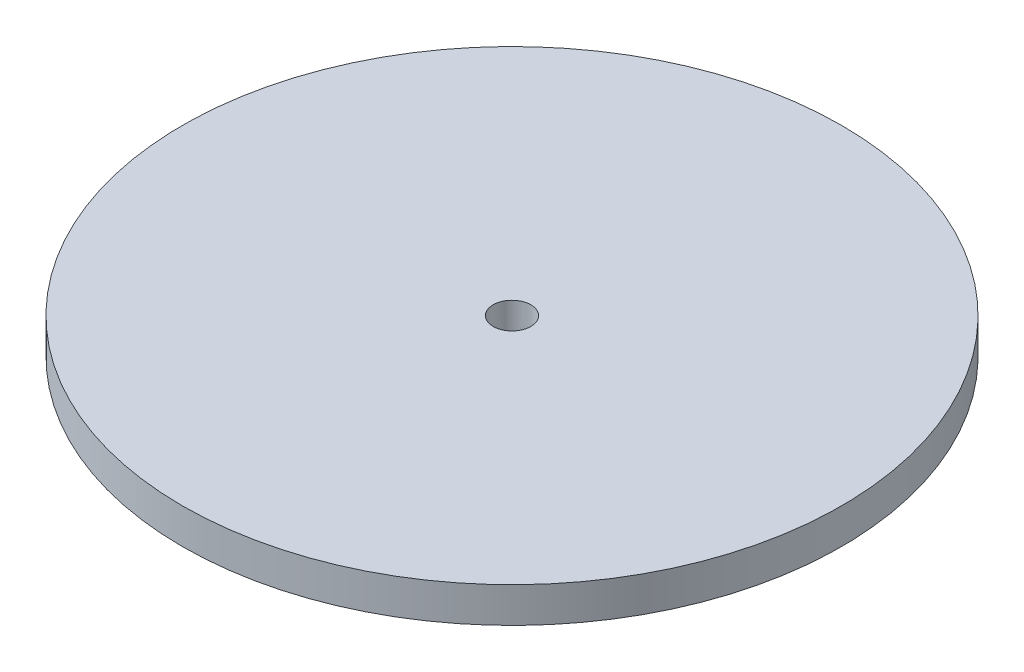
ISO-10303-21;
HEADER;
FILE_DESCRIPTION(('STEP AP214'),'2;1');
FILE_NAME('part.step','',(''),(''),'','','');
FILE_SCHEMA(('AUTOMOTIVE_DESIGN { 1 0 10303 214 1 1 1 1 }'));
ENDSEC;
DATA;
#1=APPLICATION_CONTEXT('core data for automotive mechanical design processes');
#2=APPLICATION_PROTOCOL_DEFINITION('international standard','automotive_design',2000,#1);
#3=PRODUCT_CONTEXT('',#1,'mechanical');
#4=PRODUCT('Part','Part','',(#3));
#5=PRODUCT_RELATED_PRODUCT_CATEGORY('part','',(#4));
#6=PRODUCT_DEFINITION_FORMATION('','',#4);
#7=PRODUCT_DEFINITION_CONTEXT('part definition',#1,'design');
#8=PRODUCT_DEFINITION('design','',#6,#7);
#9=PRODUCT_DEFINITION_SHAPE('','',#8);
#10=(LENGTH_UNIT() NAMED_UNIT(*) SI_UNIT(.MILLI.,.METRE.));
#11=(NAMED_UNIT(*) PLANE_ANGLE_UNIT() SI_UNIT($,.RADIAN.));
#12=(NAMED_UNIT(*) SI_UNIT($,.STERADIAN.) SOLID_ANGLE_UNIT());
#13=UNCERTAINTY_MEASURE_WITH_UNIT(LENGTH_MEASURE(1.E-05),#10,'distance_accuracy_value','');
#14=(GEOMETRIC_REPRESENTATION_CONTEXT(3) GLOBAL_UNCERTAINTY_ASSIGNED_CONTEXT((#13)) GLOBAL_UNIT_ASSIGNED_CONTEXT((#10,
#11,#12)) REPRESENTATION_CONTEXT('',''));
#15=CARTESIAN_POINT('',(0.,0.,0.));
#16=DIRECTION('',(0.,0.,1.));
#17=DIRECTION('',(1.,0.,0.));
#18=AXIS2_PLACEMENT_3D('',#15,#16,#17);
#19=CARTESIAN_POINT('',(0.,15.,0.));
#20=DIRECTION('',(0.,-1.,0.));
#21=DIRECTION('',(0.,0.,-1.));
#22=AXIS2_PLACEMENT_3D('',#19,#20,#21);
#23=CYLINDRICAL_SURFACE('',#22,140.);
#24=CARTESIAN_POINT('',(0.,15.,0.));
#25=DIRECTION('',(0.,1.,0.));
#26=DIRECTION('',(0.,0.,1.));
#27=AXIS2_PLACEMENT_3D('',#24,#25,#26);
#28=CIRCLE('',#27,140.);
#29=CARTESIAN_POINT('',(0.,15.,140.));
#30=VERTEX_POINT('',#29);
#31=EDGE_CURVE('E12',#30,#30,#28,.T.);
#32=ORIENTED_EDGE('',*,*,#31,.F.);
#33=EDGE_LOOP('',(#32));
#34=FACE_BOUND('',#33,.T.);
#35=CARTESIAN_POINT('',(0.,0.,0.));
#36=DIRECTION('',(0.,1.,0.));
#37=DIRECTION('',(0.,0.,1.));
#38=AXIS2_PLACEMENT_3D('',#35,#36,#37);
#39=CIRCLE('',#38,140.);
#40=CARTESIAN_POINT('',(0.,0.,140.));
#41=VERTEX_POINT('',#40);
#42=EDGE_CURVE('E51',#41,#41,#39,.T.);
#43=ORIENTED_EDGE('',*,*,#42,.T.);
#44=EDGE_LOOP('',(#43));
#45=FACE_BOUND('',#44,.T.);
#46=ADVANCED_FACE('F48',(#34,#45),#23,.T.);
#47=CARTESIAN_POINT('',(0.,15.,0.));
#48=DIRECTION('',(0.,1.,0.));
#49=DIRECTION('',(0.,0.,1.));
#50=AXIS2_PLACEMENT_3D('',#47,#48,#49);
#51=PLANE('',#50);
#52=CARTESIAN_POINT('',(0.,15.,0.));
#53=DIRECTION('',(0.,1.,0.));
#54=DIRECTION('',(0.,0.,1.));
#55=AXIS2_PLACEMENT_3D('',#52,#53,#54);
#56=CIRCLE('',#55,8.);
#57=CARTESIAN_POINT('',(0.,15.,8.));
#58=VERTEX_POINT('',#57);
#59=EDGE_CURVE('E60',#58,#58,#56,.T.);
#60=ORIENTED_EDGE('',*,*,#59,.F.);
#61=EDGE_LOOP('',(#60));
#62=FACE_BOUND('',#61,.T.);
#63=ORIENTED_EDGE('',*,*,#31,.T.);
#64=EDGE_LOOP('',(#63));
#65=FACE_BOUND('',#64,.T.);
#66=ADVANCED_FACE('F75',(#62,#65),#51,.T.);
#67=CARTESIAN_POINT('',(0.,0.,0.));
#68=DIRECTION('',(0.,1.,0.));
#69=DIRECTION('',(0.,0.,1.));
#70=AXIS2_PLACEMENT_3D('',#67,#68,#69);
#71=PLANE('',#70);
#72=CARTESIAN_POINT('',(0.,0.,0.));
#73=DIRECTION('',(0.,1.,0.));
#74=DIRECTION('',(0.,0.,1.));
#75=AXIS2_PLACEMENT_3D('',#72,#73,#74);
#76=CIRCLE('',#75,8.);
#77=CARTESIAN_POINT('',(0.,0.,8.));
#78=VERTEX_POINT('',#77);
#79=EDGE_CURVE('E58',#78,#78,#76,.T.);
#80=ORIENTED_EDGE('',*,*,#79,.T.);
#81=EDGE_LOOP('',(#80));
#82=FACE_BOUND('',#81,.T.);
#83=ORIENTED_EDGE('',*,*,#42,.F.);
#84=EDGE_LOOP('',(#83));
#85=FACE_BOUND('',#84,.T.);
#86=ADVANCED_FACE('F66',(#82,#85),#71,.F.);
#87=CARTESIAN_POINT('',(0.,0.,0.));
#88=DIRECTION('',(0.,1.,0.));
#89=DIRECTION('',(0.,0.,1.));
#90=AXIS2_PLACEMENT_3D('',#87,#88,#89);
#91=CYLINDRICAL_SURFACE('',#90,8.);
#92=ORIENTED_EDGE('',*,*,#79,.F.);
#93=EDGE_LOOP('',(#92));
#94=FACE_BOUND('',#93,.T.);
#95=ORIENTED_EDGE('',*,*,#59,.T.);
#96=EDGE_LOOP('',(#95));
#97=FACE_BOUND('',#96,.T.);
#98=ADVANCED_FACE('F69',(#94,#97),#91,.F.);
#99=CLOSED_SHELL('',(#46,#66,#86,#98));
#100=MANIFOLD_SOLID_BREP('B2',#99);
#101=ADVANCED_BREP_SHAPE_REPRESENTATION('',(#18,#100),#14);
#102=SHAPE_DEFINITION_REPRESENTATION(#9,#101);
ENDSEC;
END-ISO-10303-21;
